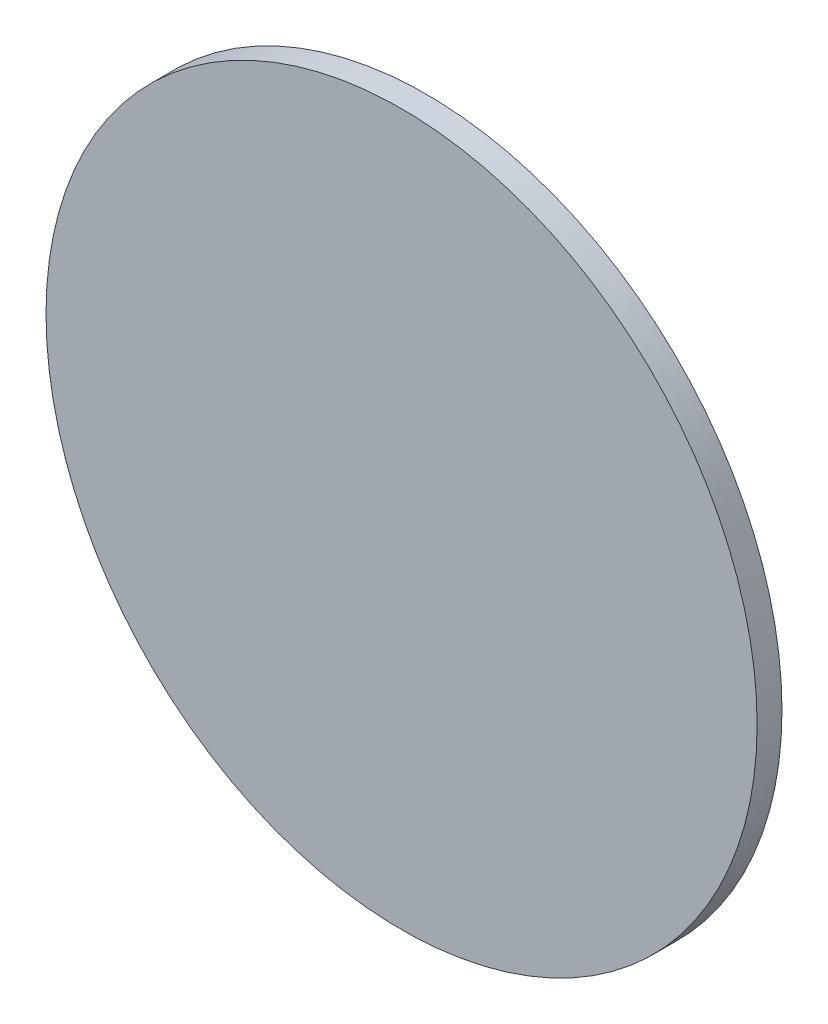
ISO-10303-21;
HEADER;
FILE_DESCRIPTION(('STEP AP214'),'2;1');
FILE_NAME('part.step','',(''),(''),'','','');
FILE_SCHEMA(('AUTOMOTIVE_DESIGN { 1 0 10303 214 1 1 1 1 }'));
ENDSEC;
DATA;
#1=APPLICATION_CONTEXT('core data for automotive mechanical design processes');
#2=APPLICATION_PROTOCOL_DEFINITION('international standard','automotive_design',2000,#1);
#3=PRODUCT_CONTEXT('',#1,'mechanical');
#4=PRODUCT('Part','Part','',(#3));
#5=PRODUCT_RELATED_PRODUCT_CATEGORY('part','',(#4));
#6=PRODUCT_DEFINITION_FORMATION('','',#4);
#7=PRODUCT_DEFINITION_CONTEXT('part definition',#1,'design');
#8=PRODUCT_DEFINITION('design','',#6,#7);
#9=PRODUCT_DEFINITION_SHAPE('','',#8);
#10=(LENGTH_UNIT() NAMED_UNIT(*) SI_UNIT(.MILLI.,.METRE.));
#11=(NAMED_UNIT(*) PLANE_ANGLE_UNIT() SI_UNIT($,.RADIAN.));
#12=(NAMED_UNIT(*) SI_UNIT($,.STERADIAN.) SOLID_ANGLE_UNIT());
#13=UNCERTAINTY_MEASURE_WITH_UNIT(LENGTH_MEASURE(1.E-05),#10,'distance_accuracy_value','');
#14=(GEOMETRIC_REPRESENTATION_CONTEXT(3) GLOBAL_UNCERTAINTY_ASSIGNED_CONTEXT((#13)) GLOBAL_UNIT_ASSIGNED_CONTEXT((#10,
#11,#12)) REPRESENTATION_CONTEXT('',''));
#15=CARTESIAN_POINT('',(0.,0.,0.));
#16=DIRECTION('',(0.,0.,1.));
#17=DIRECTION('',(1.,0.,0.));
#18=AXIS2_PLACEMENT_3D('',#15,#16,#17);
#19=CARTESIAN_POINT('',(0.,0.,10.));
#20=DIRECTION('',(0.,0.,-1.));
#21=DIRECTION('',(-1.,0.,0.));
#22=AXIS2_PLACEMENT_3D('',#19,#20,#21);
#23=CYLINDRICAL_SURFACE('',#22,143.);
#24=CARTESIAN_POINT('',(0.,0.,10.));
#25=DIRECTION('',(0.,0.,1.));
#26=DIRECTION('',(1.,0.,0.));
#27=AXIS2_PLACEMENT_3D('',#24,#25,#26);
#28=CIRCLE('',#27,143.);
#29=CARTESIAN_POINT('',(143.,0.,10.));
#30=VERTEX_POINT('',#29);
#31=EDGE_CURVE('E10',#30,#30,#28,.T.);
#32=ORIENTED_EDGE('',*,*,#31,.F.);
#33=EDGE_LOOP('',(#32));
#34=FACE_BOUND('',#33,.T.);
#35=CARTESIAN_POINT('',(0.,0.,0.));
#36=DIRECTION('',(0.,0.,1.));
#37=DIRECTION('',(1.,0.,0.));
#38=AXIS2_PLACEMENT_3D('',#35,#36,#37);
#39=CIRCLE('',#38,143.);
#40=CARTESIAN_POINT('',(143.,0.,0.));
#41=VERTEX_POINT('',#40);
#42=EDGE_CURVE('E38',#41,#41,#39,.T.);
#43=ORIENTED_EDGE('',*,*,#42,.T.);
#44=EDGE_LOOP('',(#43));
#45=FACE_BOUND('',#44,.T.);
#46=ADVANCED_FACE('F35',(#34,#45),#23,.T.);
#47=CARTESIAN_POINT('',(0.,0.,10.));
#48=DIRECTION('',(0.,0.,1.));
#49=DIRECTION('',(1.,0.,0.));
#50=AXIS2_PLACEMENT_3D('',#47,#48,#49);
#51=PLANE('',#50);
#52=ORIENTED_EDGE('',*,*,#31,.T.);
#53=EDGE_LOOP('',(#52));
#54=FACE_BOUND('',#53,.T.);
#55=ADVANCED_FACE('F50',(#54),#51,.T.);
#56=CARTESIAN_POINT('',(0.,0.,0.));
#57=DIRECTION('',(0.,0.,1.));
#58=DIRECTION('',(1.,0.,0.));
#59=AXIS2_PLACEMENT_3D('',#56,#57,#58);
#60=PLANE('',#59);
#61=ORIENTED_EDGE('',*,*,#42,.F.);
#62=EDGE_LOOP('',(#61));
#63=FACE_BOUND('',#62,.T.);
#64=ADVANCED_FACE('F48',(#63),#60,.F.);
#65=CLOSED_SHELL('',(#46,#55,#64));
#66=MANIFOLD_SOLID_BREP('B2',#65);
#67=ADVANCED_BREP_SHAPE_REPRESENTATION('',(#18,#66),#14);
#68=SHAPE_DEFINITION_REPRESENTATION(#9,#67);
ENDSEC;
END-ISO-10303-21;
